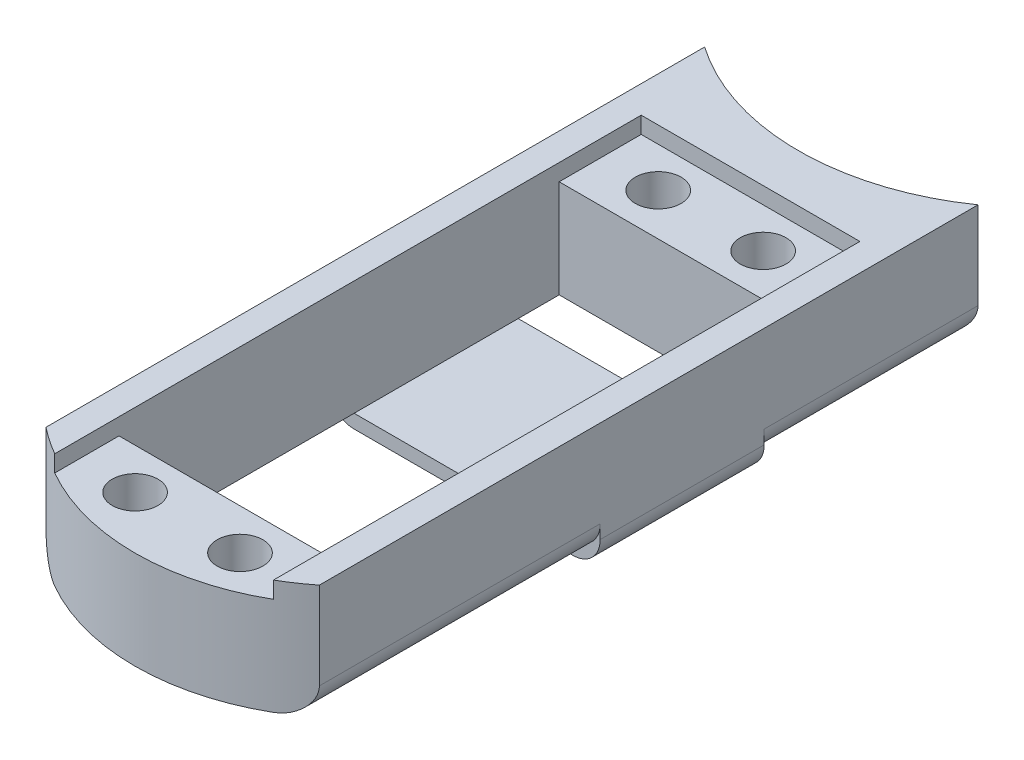
ISO-10303-21;
HEADER;
FILE_DESCRIPTION(('STEP AP214'),'2;1');
FILE_NAME('part.step','',(''),(''),'','','');
FILE_SCHEMA(('AUTOMOTIVE_DESIGN { 1 0 10303 214 1 1 1 1 }'));
ENDSEC;
DATA;
#1=APPLICATION_CONTEXT('core data for automotive mechanical design processes');
#2=APPLICATION_PROTOCOL_DEFINITION('international standard','automotive_design',2000,#1);
#3=PRODUCT_CONTEXT('',#1,'mechanical');
#4=PRODUCT('Part','Part','',(#3));
#5=PRODUCT_RELATED_PRODUCT_CATEGORY('part','',(#4));
#6=PRODUCT_DEFINITION_FORMATION('','',#4);
#7=PRODUCT_DEFINITION_CONTEXT('part definition',#1,'design');
#8=PRODUCT_DEFINITION('design','',#6,#7);
#9=PRODUCT_DEFINITION_SHAPE('','',#8);
#10=(LENGTH_UNIT() NAMED_UNIT(*) SI_UNIT(.MILLI.,.METRE.));
#11=(NAMED_UNIT(*) PLANE_ANGLE_UNIT() SI_UNIT($,.RADIAN.));
#12=(NAMED_UNIT(*) SI_UNIT($,.STERADIAN.) SOLID_ANGLE_UNIT());
#13=UNCERTAINTY_MEASURE_WITH_UNIT(LENGTH_MEASURE(1.E-05),#10,'distance_accuracy_value','');
#14=(GEOMETRIC_REPRESENTATION_CONTEXT(3) GLOBAL_UNCERTAINTY_ASSIGNED_CONTEXT((#13)) GLOBAL_UNIT_ASSIGNED_CONTEXT((#10,
#11,#12)) REPRESENTATION_CONTEXT('',''));
#15=CARTESIAN_POINT('',(0.,0.,0.));
#16=DIRECTION('',(0.,0.,1.));
#17=DIRECTION('',(1.,0.,0.));
#18=AXIS2_PLACEMENT_3D('',#15,#16,#17);
#19=CARTESIAN_POINT('',(0.,-10.65022,-63.5));
#20=DIRECTION('',(0.,1.,0.));
#21=DIRECTION('',(0.,0.,1.));
#22=AXIS2_PLACEMENT_3D('',#19,#20,#21);
#23=PLANE('',#22);
#24=CARTESIAN_POINT('',(4.87426,-10.65022,15.47622));
#25=DIRECTION('',(0.,1.,0.));
#26=DIRECTION('',(0.,0.,1.));
#27=AXIS2_PLACEMENT_3D('',#24,#25,#26);
#28=CIRCLE('',#27,2.12598);
#29=CARTESIAN_POINT('',(4.87426,-10.65022,17.6022));
#30=VERTEX_POINT('',#29);
#31=EDGE_CURVE('E869',#30,#30,#28,.F.);
#32=ORIENTED_EDGE('',*,*,#31,.F.);
#33=EDGE_LOOP('',(#32));
#34=FACE_BOUND('',#33,.T.);
#35=CARTESIAN_POINT('',(-4.87426,-10.65022,15.47622));
#36=DIRECTION('',(0.,1.,0.));
#37=DIRECTION('',(0.,0.,1.));
#38=AXIS2_PLACEMENT_3D('',#35,#36,#37);
#39=CIRCLE('',#38,2.12598);
#40=CARTESIAN_POINT('',(-4.87426,-10.65022,17.6022));
#41=VERTEX_POINT('',#40);
#42=EDGE_CURVE('E873',#41,#41,#39,.F.);
#43=ORIENTED_EDGE('',*,*,#42,.F.);
#44=EDGE_LOOP('',(#43));
#45=FACE_BOUND('',#44,.T.);
#46=DIRECTION('',(1.,0.,0.));
#47=VECTOR('',#46,1.);
#48=CARTESIAN_POINT('',(10.16,-10.65022,11.684));
#49=LINE('',#48,#47);
#50=CARTESIAN_POINT('',(-10.16,-10.65022,11.684));
#51=VERTEX_POINT('',#50);
#52=CARTESIAN_POINT('',(10.16,-10.65022,11.684));
#53=VERTEX_POINT('',#52);
#54=EDGE_CURVE('E874',#51,#53,#49,.T.);
#55=ORIENTED_EDGE('',*,*,#54,.T.);
#56=DIRECTION('',(0.,0.,-1.));
#57=VECTOR('',#56,1.);
#58=CARTESIAN_POINT('',(10.16,-10.65022,15.9273190663087));
#59=LINE('',#58,#57);
#60=CARTESIAN_POINT('',(10.16,-10.65022,17.6562706322711));
#61=VERTEX_POINT('',#60);
#62=EDGE_CURVE('E236',#53,#61,#59,.F.);
#63=ORIENTED_EDGE('',*,*,#62,.T.);
#64=CARTESIAN_POINT('',(0.,-10.65022,0.));
#65=DIRECTION('',(0.,1.,0.));
#66=DIRECTION('',(0.,0.,-1.));
#67=AXIS2_PLACEMENT_3D('',#64,#65,#66);
#68=CIRCLE('',#67,20.3708);
#69=CARTESIAN_POINT('',(-10.16,-10.65022,17.6562706322711));
#70=VERTEX_POINT('',#69);
#71=EDGE_CURVE('E413',#70,#61,#68,.T.);
#72=ORIENTED_EDGE('',*,*,#71,.F.);
#73=DIRECTION('',(0.,0.,1.));
#74=VECTOR('',#73,1.);
#75=CARTESIAN_POINT('',(-10.16,-10.65022,-10.16));
#76=LINE('',#75,#74);
#77=EDGE_CURVE('E266',#70,#51,#76,.F.);
#78=ORIENTED_EDGE('',*,*,#77,.T.);
#79=EDGE_LOOP('',(#55,#63,#72,#78));
#80=FACE_BOUND('',#79,.T.);
#81=ADVANCED_FACE('F43',(#34,#45,#80),#23,.F.);
#82=CARTESIAN_POINT('',(-10.16,-10.65022,-29.21));
#83=DIRECTION('',(0.,0.,1.));
#84=DIRECTION('',(1.,0.,0.));
#85=AXIS2_PLACEMENT_3D('',#82,#83,#84);
#86=PLANE('',#85);
#87=DIRECTION('',(0.,1.,0.));
#88=VECTOR('',#87,1.);
#89=CARTESIAN_POINT('',(10.16,-10.65022,-29.21));
#90=LINE('',#89,#88);
#91=CARTESIAN_POINT('',(10.16,-10.65022,-29.21));
#92=VERTEX_POINT('',#91);
#93=CARTESIAN_POINT('',(10.16,-1.5494,-29.21));
#94=VERTEX_POINT('',#93);
#95=EDGE_CURVE('E434',#92,#94,#90,.T.);
#96=ORIENTED_EDGE('',*,*,#95,.T.);
#97=DIRECTION('',(1.,0.,0.));
#98=VECTOR('',#97,1.);
#99=CARTESIAN_POINT('',(-10.16,-1.5494,-29.21));
#100=LINE('',#99,#98);
#101=CARTESIAN_POINT('',(-10.16,-1.5494,-29.21));
#102=VERTEX_POINT('',#101);
#103=EDGE_CURVE('E385',#102,#94,#100,.T.);
#104=ORIENTED_EDGE('',*,*,#103,.F.);
#105=DIRECTION('',(0.,1.,0.));
#106=VECTOR('',#105,1.);
#107=CARTESIAN_POINT('',(-10.16,-10.65022,-29.21));
#108=LINE('',#107,#106);
#109=CARTESIAN_POINT('',(-10.16,-10.65022,-29.21));
#110=VERTEX_POINT('',#109);
#111=EDGE_CURVE('E429',#110,#102,#108,.T.);
#112=ORIENTED_EDGE('',*,*,#111,.F.);
#113=DIRECTION('',(1.,0.,0.));
#114=VECTOR('',#113,1.);
#115=CARTESIAN_POINT('',(-10.16,-10.65022,-29.21));
#116=LINE('',#115,#114);
#117=EDGE_CURVE('E238',#110,#92,#116,.T.);
#118=ORIENTED_EDGE('',*,*,#117,.T.);
#119=EDGE_LOOP('',(#96,#104,#112,#118));
#120=FACE_BOUND('',#119,.T.);
#121=ADVANCED_FACE('F324',(#120),#86,.T.);
#122=CARTESIAN_POINT('',(0.,-10.65022,-63.5));
#123=DIRECTION('',(0.,1.,0.));
#124=DIRECTION('',(0.,0.,1.));
#125=AXIS2_PLACEMENT_3D('',#122,#123,#124);
#126=CYLINDRICAL_SURFACE('',#125,22.225);
#127=CARTESIAN_POINT('',(0.,-10.65022,-63.5));
#128=DIRECTION('',(0.,-1.,0.));
#129=DIRECTION('',(0.,0.,1.));
#130=AXIS2_PLACEMENT_3D('',#127,#128,#129);
#131=CIRCLE('',#130,22.225);
#132=CARTESIAN_POINT('',(10.16,-10.65022,-43.7332343313328));
#133=VERTEX_POINT('',#132);
#134=CARTESIAN_POINT('',(-10.16,-10.65022,-43.7332343313328));
#135=VERTEX_POINT('',#134);
#136=EDGE_CURVE('E409',#133,#135,#131,.T.);
#137=ORIENTED_EDGE('',*,*,#136,.T.);
#138=CARTESIAN_POINT('',(-10.16,-10.65022,-43.7332343313328));
#139=CARTESIAN_POINT('',(-10.2411956702707,-10.650213219014,-43.7749650155898));
#140=CARTESIAN_POINT('',(-10.3220836497185,-10.6463255690827,-43.817177586526));
#141=CARTESIAN_POINT('',(-10.4827588320444,-10.6309244694955,-43.9022797833927));
#142=CARTESIAN_POINT('',(-10.5625461683666,-10.6194119527371,-43.9451693258698));
#143=CARTESIAN_POINT('',(-10.7997970191303,-10.5735935544241,-44.0745687615082));
#144=CARTESIAN_POINT('',(-10.9549019817185,-10.5280076270302,-44.1616820960238));
#145=CARTESIAN_POINT('',(-11.25438138905,-10.4080456274678,-44.3344189820127));
#146=CARTESIAN_POINT('',(-11.3987536044259,-10.333663593684,-44.4200422211557));
#147=CARTESIAN_POINT('',(-11.6725838006467,-10.1572029252506,-44.586328174225));
#148=CARTESIAN_POINT('',(-11.8020613862865,-10.0551613051963,-44.6669973420872));
#149=CARTESIAN_POINT('',(-12.0190819062862,-9.84622195564051,-44.8049291861434));
#150=CARTESIAN_POINT('',(-12.1099415853167,-9.74378280644813,-44.8637507445398));
#151=CARTESIAN_POINT('',(-12.2757821795999,-9.52235748755073,-44.9725710674338));
#152=CARTESIAN_POINT('',(-12.3507647248859,-9.40337301855859,-45.0225707375467));
#153=CARTESIAN_POINT('',(-12.4489156896742,-9.21367993363353,-45.0886797546202));
#154=CARTESIAN_POINT('',(-12.4793654147968,-9.14821060077142,-45.1093177585253));
#155=CARTESIAN_POINT('',(-12.5348525671686,-9.01406295282559,-45.147092341245));
#156=CARTESIAN_POINT('',(-12.5598931524025,-8.94538653875295,-45.1642309627605));
#157=CARTESIAN_POINT('',(-12.6040917894358,-8.80548147194342,-45.1945850793223));
#158=CARTESIAN_POINT('',(-12.6232614871069,-8.73425818908545,-45.2078083393798));
#159=CARTESIAN_POINT('',(-12.6554056088195,-8.58982153435533,-45.2300323991752));
#160=CARTESIAN_POINT('',(-12.6683845344947,-8.51660964956995,-45.23903626697));
#161=CARTESIAN_POINT('',(-12.6853967382599,-8.38779468623727,-45.2508516687437));
#162=CARTESIAN_POINT('',(-12.6908678119887,-8.33246715196801,-45.254657191066));
#163=CARTESIAN_POINT('',(-12.6981712890002,-8.22150332769454,-45.2597402573317));
#164=CARTESIAN_POINT('',(-12.700006678167,-8.16586732871663,-45.2610198757253));
#165=CARTESIAN_POINT('',(-12.7,-8.11022,-45.2610135972418));
#166=B_SPLINE_CURVE_WITH_KNOTS('',3,(#138,#139,#140,#141,#142,#143,#144,#145,#146,#147,#148,
#149,#150,#151,#152,#153,#154,#155,#156,#157,#158,#159,#160,#161,#162,#163,#164,#165),
.UNSPECIFIED.,.F.,.F.,(4,2,2,2,2,2,2,2,2,2,2,2,2,4),(0.,0.273690290378596,0.547347101113361,
1.09548494880222,1.64373633739529,2.19125763688939,2.63661929186714,3.08193520139089,
3.30693726394514,3.53180760775837,3.75622895103776,3.98048685611531,4.14750009268392,
4.31437610907304),.UNSPECIFIED.);
#167=CARTESIAN_POINT('',(-12.7,-8.11022,-45.2610135972418));
#168=VERTEX_POINT('',#167);
#169=EDGE_CURVE('E209',#135,#168,#166,.T.);
#170=ORIENTED_EDGE('',*,*,#169,.T.);
#171=DIRECTION('',(0.,1.,0.));
#172=VECTOR('',#171,1.);
#173=CARTESIAN_POINT('',(-12.7,-10.65022,-45.2610135972418));
#174=LINE('',#173,#172);
#175=CARTESIAN_POINT('',(-12.7,0.,-45.2610135972418));
#176=VERTEX_POINT('',#175);
#177=EDGE_CURVE('E245',#168,#176,#174,.T.);
#178=ORIENTED_EDGE('',*,*,#177,.T.);
#179=CARTESIAN_POINT('',(0.,0.,-63.5));
#180=DIRECTION('',(0.,-1.,0.));
#181=DIRECTION('',(0.,0.,1.));
#182=AXIS2_PLACEMENT_3D('',#179,#180,#181);
#183=CIRCLE('',#182,22.225);
#184=CARTESIAN_POINT('',(12.7,0.,-45.2610135972418));
#185=VERTEX_POINT('',#184);
#186=EDGE_CURVE('E405',#185,#176,#183,.T.);
#187=ORIENTED_EDGE('',*,*,#186,.F.);
#188=DIRECTION('',(0.,1.,0.));
#189=VECTOR('',#188,1.);
#190=CARTESIAN_POINT('',(12.7,-10.65022,-45.2610135972418));
#191=LINE('',#190,#189);
#192=CARTESIAN_POINT('',(12.7,-8.11022,-45.2610135972418));
#193=VERTEX_POINT('',#192);
#194=EDGE_CURVE('E263',#193,#185,#191,.T.);
#195=ORIENTED_EDGE('',*,*,#194,.F.);
#196=CARTESIAN_POINT('',(12.7,-8.11022,-45.2610135972418));
#197=CARTESIAN_POINT('',(12.7000124224367,-8.17314820006339,-45.2610249850888));
#198=CARTESIAN_POINT('',(12.697661832471,-8.23606772275095,-45.2593855672142));
#199=CARTESIAN_POINT('',(12.6883304312589,-8.36136352691284,-45.252891883946));
#200=CARTESIAN_POINT('',(12.6813520374275,-8.42374007479379,-45.2480392970099));
#201=CARTESIAN_POINT('',(12.662914786554,-8.54712845561308,-45.2352434457506));
#202=CARTESIAN_POINT('',(12.6514824039029,-8.60814614091072,-45.2273184451111));
#203=CARTESIAN_POINT('',(12.6243162692221,-8.72874337089769,-45.2085392643565));
#204=CARTESIAN_POINT('',(12.6085821507773,-8.78832279260726,-45.1976848347181));
#205=CARTESIAN_POINT('',(12.5552953636709,-8.96408961751221,-45.1610509446185));
#206=CARTESIAN_POINT('',(12.511607072056,-9.07763862485482,-45.1311648891252));
#207=CARTESIAN_POINT('',(12.4098864076835,-9.29516238031463,-45.0622913627142));
#208=CARTESIAN_POINT('',(12.351834511841,-9.39912383075703,-45.0232915083138));
#209=CARTESIAN_POINT('',(12.2186176136321,-9.60342599495554,-44.9349021908279));
#210=CARTESIAN_POINT('',(12.1424869806593,-9.70289024900739,-44.8849481964341));
#211=CARTESIAN_POINT('',(11.9784857756384,-9.88786221746243,-44.7789945220317));
#212=CARTESIAN_POINT('',(11.8906115846088,-9.9733656114651,-44.7229929793912));
#213=CARTESIAN_POINT('',(11.6893301236505,-10.1431757021891,-44.5969169963657));
#214=CARTESIAN_POINT('',(11.5741251469798,-10.2247848576827,-44.5260724159635));
#215=CARTESIAN_POINT('',(11.3333267428121,-10.367324478442,-44.381262305724));
#216=CARTESIAN_POINT('',(11.2077251476008,-10.4282384898651,-44.3072943448995));
#217=CARTESIAN_POINT('',(10.9324205967515,-10.5349605578537,-44.1490061506984));
#218=CARTESIAN_POINT('',(10.781669976857,-10.5779183309013,-44.0645503917025));
#219=CARTESIAN_POINT('',(10.551183295075,-10.6211365597625,-43.9390472498577));
#220=CARTESIAN_POINT('',(10.4736148724167,-10.6320062714512,-43.8974030621034));
#221=CARTESIAN_POINT('',(10.317461436594,-10.6465447506022,-43.8147661767872));
#222=CARTESIAN_POINT('',(10.2388763963794,-10.6502133260574,-43.7737734966256));
#223=CARTESIAN_POINT('',(10.16,-10.65022,-43.7332343313328));
#224=B_SPLINE_CURVE_WITH_KNOTS('',3,(#196,#197,#198,#199,#200,#201,#202,#203,#204,#205,#206,
#207,#208,#209,#210,#211,#212,#213,#214,#215,#216,#217,#218,#219,#220,#221,#222,#223),
.UNSPECIFIED.,.F.,.F.,(4,2,2,2,2,2,2,2,2,2,2,2,2,4),(0.,0.188705087469158,0.37731167907055,
0.564813894231544,0.752332085520987,1.12636493511534,1.50090899205671,1.9039338666932,
2.30708322808382,2.77907439630294,3.25143995153968,3.78301082538282,4.04888119911061,
4.31475866176425),.UNSPECIFIED.);
#225=EDGE_CURVE('E312',#193,#133,#224,.T.);
#226=ORIENTED_EDGE('',*,*,#225,.T.);
#227=EDGE_LOOP('',(#137,#170,#178,#187,#195,#226));
#228=FACE_BOUND('',#227,.T.);
#229=ADVANCED_FACE('F319',(#228),#126,.F.);
#230=CARTESIAN_POINT('',(12.7,-10.65022,-45.2610135972418));
#231=DIRECTION('',(1.,0.,0.));
#232=DIRECTION('',(0.,0.,-1.));
#233=AXIS2_PLACEMENT_3D('',#230,#231,#232);
#234=PLANE('',#233);
#235=DIRECTION('',(0.,1.,0.));
#236=VECTOR('',#235,1.);
#237=CARTESIAN_POINT('',(12.7,-10.65022,-10.16));
#238=LINE('',#237,#236);
#239=CARTESIAN_POINT('',(12.7,-9.38022,-10.16));
#240=VERTEX_POINT('',#239);
#241=CARTESIAN_POINT('',(12.7,-8.11022,-10.16));
#242=VERTEX_POINT('',#241);
#243=EDGE_CURVE('E202',#240,#242,#238,.T.);
#244=ORIENTED_EDGE('',*,*,#243,.F.);
#245=DIRECTION('',(0.,0.,1.));
#246=VECTOR('',#245,1.);
#247=CARTESIAN_POINT('',(12.7,-9.38022,-45.2610135972418));
#248=LINE('',#247,#246);
#249=CARTESIAN_POINT('',(12.7,-9.38022,-25.4));
#250=VERTEX_POINT('',#249);
#251=EDGE_CURVE('E67',#240,#250,#248,.F.);
#252=ORIENTED_EDGE('',*,*,#251,.T.);
#253=DIRECTION('',(0.,1.,0.));
#254=VECTOR('',#253,1.);
#255=CARTESIAN_POINT('',(12.7,-10.65022,-25.4));
#256=LINE('',#255,#254);
#257=CARTESIAN_POINT('',(12.7,-8.11022,-25.4));
#258=VERTEX_POINT('',#257);
#259=EDGE_CURVE('E476',#250,#258,#256,.T.);
#260=ORIENTED_EDGE('',*,*,#259,.T.);
#261=DIRECTION('',(0.,0.,-1.));
#262=VECTOR('',#261,1.);
#263=CARTESIAN_POINT('',(12.7,-8.11022,-45.2610135972418));
#264=LINE('',#263,#262);
#265=EDGE_CURVE('E258',#258,#193,#264,.T.);
#266=ORIENTED_EDGE('',*,*,#265,.T.);
#267=ORIENTED_EDGE('',*,*,#194,.T.);
#268=DIRECTION('',(0.,0.,-1.));
#269=VECTOR('',#268,1.);
#270=CARTESIAN_POINT('',(12.7,0.,-45.2610135972418));
#271=LINE('',#270,#269);
#272=CARTESIAN_POINT('',(12.7,0.,15.9273190663087));
#273=VERTEX_POINT('',#272);
#274=EDGE_CURVE('E414',#273,#185,#271,.T.);
#275=ORIENTED_EDGE('',*,*,#274,.F.);
#276=DIRECTION('',(0.,1.,0.));
#277=VECTOR('',#276,1.);
#278=CARTESIAN_POINT('',(12.7,-10.65022,15.9273190663087));
#279=LINE('',#278,#277);
#280=CARTESIAN_POINT('',(12.7,-8.11022,15.9273190663087));
#281=VERTEX_POINT('',#280);
#282=EDGE_CURVE('E443',#281,#273,#279,.T.);
#283=ORIENTED_EDGE('',*,*,#282,.F.);
#284=DIRECTION('',(0.,0.,-1.));
#285=VECTOR('',#284,1.);
#286=CARTESIAN_POINT('',(12.7,-8.11022,-10.16));
#287=LINE('',#286,#285);
#288=EDGE_CURVE('E262',#281,#242,#287,.T.);
#289=ORIENTED_EDGE('',*,*,#288,.T.);
#290=EDGE_LOOP('',(#244,#252,#260,#266,#267,#275,#283,#289));
#291=FACE_BOUND('',#290,.T.);
#292=ADVANCED_FACE('F323',(#291),#234,.T.);
#293=CARTESIAN_POINT('',(0.,-10.65022,0.));
#294=DIRECTION('',(0.,1.,0.));
#295=DIRECTION('',(0.,0.,1.));
#296=AXIS2_PLACEMENT_3D('',#293,#294,#295);
#297=CYLINDRICAL_SURFACE('',#296,20.3708);
#298=ORIENTED_EDGE('',*,*,#71,.T.);
#299=CARTESIAN_POINT('',(10.16,-10.65022,17.6562706322711));
#300=CARTESIAN_POINT('',(10.2538148162083,-10.6502159756248,17.6022982258125));
#301=CARTESIAN_POINT('',(10.3471674475375,-10.6450228719741,17.5475734132174));
#302=CARTESIAN_POINT('',(10.5321745938138,-10.6245295733965,17.4371524894438));
#303=CARTESIAN_POINT('',(10.6238291400995,-10.6092295651864,17.3814563962275));
#304=CARTESIAN_POINT('',(10.8050212525753,-10.5687149404447,17.2694071104446));
#305=CARTESIAN_POINT('',(10.8945492085416,-10.5434620282995,17.2130522054908));
#306=CARTESIAN_POINT('',(11.0703593551201,-10.483294213634,17.1005130762806));
#307=CARTESIAN_POINT('',(11.1566418723022,-10.4483802862163,17.044328835377));
#308=CARTESIAN_POINT('',(11.3912842326355,-10.3380268220991,16.8890636509127));
#309=CARTESIAN_POINT('',(11.5354630338032,-10.2522395644561,16.7907718473207));
#310=CARTESIAN_POINT('',(11.8066915135068,-10.0514567455969,16.6011701710848));
#311=CARTESIAN_POINT('',(11.9337793307209,-9.93652792660382,16.5098449565371));
#312=CARTESIAN_POINT('',(12.1356968003703,-9.71171506887298,16.3617175092734));
#313=CARTESIAN_POINT('',(12.215546378669,-9.608192640662,16.3020903513741));
#314=CARTESIAN_POINT('',(12.3601287737346,-9.38634705413062,16.1927424902321));
#315=CARTESIAN_POINT('',(12.424878347384,-9.26804052829626,16.1430108147915));
#316=CARTESIAN_POINT('',(12.5271444792161,-9.03835898170032,16.0637375779615));
#317=CARTESIAN_POINT('',(12.5673508843979,-8.92885775815248,16.0322452095407));
#318=CARTESIAN_POINT('',(12.6326616499522,-8.70292129277281,15.9808355344892));
#319=CARTESIAN_POINT('',(12.657795459929,-8.58650006427387,15.9608956586124));
#320=CARTESIAN_POINT('',(12.6830491666576,-8.40921736244485,15.9408237434623));
#321=CARTESIAN_POINT('',(12.6893924894487,-8.34971669183741,15.9357728382344));
#322=CARTESIAN_POINT('',(12.6978706521246,-8.23022887700469,15.9290171460207));
#323=CARTESIAN_POINT('',(12.7000055143872,-8.17024173536782,15.9273123412427));
#324=CARTESIAN_POINT('',(12.7,-8.11022,15.9273190663087));
#325=B_SPLINE_CURVE_WITH_KNOTS('',3,(#299,#300,#301,#302,#303,#304,#305,#306,#307,#308,#309,
#310,#311,#312,#313,#314,#315,#316,#317,#318,#319,#320,#321,#322,#323,#324),.UNSPECIFIED.,.F.,
.F.,(4,2,2,2,2,2,2,2,2,2,2,2,4),(0.,0.324531610117718,0.649057224944756,0.974843896318075,
1.30059769747699,1.88091956121222,2.45992414684536,2.88940644684679,3.31840984636045,
3.67941179184597,4.03970607560343,4.21964404381826,4.39958105524908),.UNSPECIFIED.);
#326=EDGE_CURVE('E280',#61,#281,#325,.T.);
#327=ORIENTED_EDGE('',*,*,#326,.T.);
#328=ORIENTED_EDGE('',*,*,#282,.T.);
#329=CARTESIAN_POINT('',(0.,0.,0.));
#330=DIRECTION('',(0.,1.,0.));
#331=DIRECTION('',(0.,0.,1.));
#332=AXIS2_PLACEMENT_3D('',#329,#330,#331);
#333=CIRCLE('',#332,20.3708);
#334=CARTESIAN_POINT('',(10.16,0.,17.6562706322711));
#335=VERTEX_POINT('',#334);
#336=EDGE_CURVE('E451',#335,#273,#333,.T.);
#337=ORIENTED_EDGE('',*,*,#336,.F.);
#338=DIRECTION('',(0.,1.,0.));
#339=VECTOR('',#338,1.);
#340=CARTESIAN_POINT('',(10.16,-10.65022,17.6562706322711));
#341=LINE('',#340,#339);
#342=CARTESIAN_POINT('',(10.16,-1.5494,17.6562706322711));
#343=VERTEX_POINT('',#342);
#344=EDGE_CURVE('E438',#343,#335,#341,.T.);
#345=ORIENTED_EDGE('',*,*,#344,.F.);
#346=CARTESIAN_POINT('',(0.,-1.5494,0.));
#347=DIRECTION('',(0.,1.,0.));
#348=DIRECTION('',(0.,0.,1.));
#349=AXIS2_PLACEMENT_3D('',#346,#347,#348);
#350=CIRCLE('',#349,20.3708);
#351=CARTESIAN_POINT('',(-10.16,-1.5494,17.6562706322711));
#352=VERTEX_POINT('',#351);
#353=EDGE_CURVE('E897',#352,#343,#350,.T.);
#354=ORIENTED_EDGE('',*,*,#353,.F.);
#355=DIRECTION('',(0.,1.,0.));
#356=VECTOR('',#355,1.);
#357=CARTESIAN_POINT('',(-10.16,-10.65022,17.6562706322711));
#358=LINE('',#357,#356);
#359=CARTESIAN_POINT('',(-10.16,0.,17.6562706322711));
#360=VERTEX_POINT('',#359);
#361=EDGE_CURVE('E254',#352,#360,#358,.T.);
#362=ORIENTED_EDGE('',*,*,#361,.T.);
#363=CARTESIAN_POINT('',(0.,0.,0.));
#364=DIRECTION('',(0.,1.,0.));
#365=DIRECTION('',(0.,0.,-1.));
#366=AXIS2_PLACEMENT_3D('',#363,#364,#365);
#367=CIRCLE('',#366,20.3708);
#368=CARTESIAN_POINT('',(-12.7,0.,15.9273190663087));
#369=VERTEX_POINT('',#368);
#370=EDGE_CURVE('E462',#369,#360,#367,.T.);
#371=ORIENTED_EDGE('',*,*,#370,.F.);
#372=DIRECTION('',(0.,1.,0.));
#373=VECTOR('',#372,1.);
#374=CARTESIAN_POINT('',(-12.7,-10.65022,15.9273190663087));
#375=LINE('',#374,#373);
#376=CARTESIAN_POINT('',(-12.7,-8.11022,15.9273190663087));
#377=VERTEX_POINT('',#376);
#378=EDGE_CURVE('E247',#377,#369,#375,.T.);
#379=ORIENTED_EDGE('',*,*,#378,.F.);
#380=CARTESIAN_POINT('',(-12.7,-8.11022,15.9273190663087));
#381=CARTESIAN_POINT('',(-12.7000133519998,-8.17139406363251,15.9273053521786));
#382=CARTESIAN_POINT('',(-12.6977904530714,-8.23255801319959,15.9290808329105));
#383=CARTESIAN_POINT('',(-12.6889753096657,-8.35433079708027,15.9361054161304));
#384=CARTESIAN_POINT('',(-12.6823859033071,-8.41493996606208,15.9413522623156));
#385=CARTESIAN_POINT('',(-12.6650010104189,-8.53473315481904,15.9551670981723));
#386=CARTESIAN_POINT('',(-12.6542349422509,-8.59392413382748,15.9637118568498));
#387=CARTESIAN_POINT('',(-12.6286840271113,-8.71087526449833,15.9839324844282));
#388=CARTESIAN_POINT('',(-12.6138987276821,-8.76863525427047,15.9956087058458));
#389=CARTESIAN_POINT('',(-12.5639130336118,-8.93891743741741,16.0349426679583));
#390=CARTESIAN_POINT('',(-12.5230238589514,-9.04883498684441,16.0669532032401));
#391=CARTESIAN_POINT('',(-12.4280943392738,-9.25946142878988,16.1404942454451));
#392=CARTESIAN_POINT('',(-12.3740318469676,-9.36015441632788,16.1820407776093));
#393=CARTESIAN_POINT('',(-12.2494982461465,-9.55956842462098,16.2765448050743));
#394=CARTESIAN_POINT('',(-12.1779946484709,-9.65731532040022,16.3301889938996));
#395=CARTESIAN_POINT('',(-12.0241463237678,-9.83961388049437,16.4437998228766));
#396=CARTESIAN_POINT('',(-11.9417989117826,-9.924162265454,16.5037680281371));
#397=CARTESIAN_POINT('',(-11.7498287407028,-10.096163331412,16.641144781871));
#398=CARTESIAN_POINT('',(-11.6381150159223,-10.1804736782935,16.7195655644681));
#399=CARTESIAN_POINT('',(-11.404188424463,-10.328959676251,16.8799913184253));
#400=CARTESIAN_POINT('',(-11.2819644448351,-10.3931136732741,16.9620000373371));
#401=CARTESIAN_POINT('',(-11.077475318987,-10.4802597339169,17.0958426128462));
#402=CARTESIAN_POINT('',(-10.9976327383119,-10.5096355234822,17.1473264988212));
#403=CARTESIAN_POINT('',(-10.8353815098576,-10.5602568048425,17.2503109112827));
#404=CARTESIAN_POINT('',(-10.7529724586913,-10.5815010115034,17.3018114391132));
#405=CARTESIAN_POINT('',(-10.5862187165114,-10.6156496842739,17.4043391767418));
#406=CARTESIAN_POINT('',(-10.501875079963,-10.62855858679,17.455366624055));
#407=CARTESIAN_POINT('',(-10.331815993056,-10.6458423830279,17.5565640115108));
#408=CARTESIAN_POINT('',(-10.246100580599,-10.6502175121262,17.6067339752667));
#409=CARTESIAN_POINT('',(-10.16,-10.65022,17.6562706322711));
#410=B_SPLINE_CURVE_WITH_KNOTS('',3,(#380,#381,#382,#383,#384,#385,#386,#387,#388,#389,#390,
#391,#392,#393,#394,#395,#396,#397,#398,#399,#400,#401,#402,#403,#404,#405,#406,#407,#408,#409),
.UNSPECIFIED.,.F.,.F.,(4,2,2,2,2,2,2,2,2,2,2,2,2,2,4),(0.,0.183439532932148,0.3667599516277,
0.548811931931778,0.73088441489894,1.09384391609419,1.45741789534638,1.85336879060913,
2.24941790937985,2.7289240999277,3.20894367841838,3.50693940974972,3.80498221758558,
4.10286626320486,4.40074209253602),.UNSPECIFIED.);
#411=EDGE_CURVE('E271',#377,#70,#410,.T.);
#412=ORIENTED_EDGE('',*,*,#411,.T.);
#413=EDGE_LOOP('',(#298,#327,#328,#337,#345,#354,#362,#371,#379,#412));
#414=FACE_BOUND('',#413,.T.);
#415=ADVANCED_FACE('F287',(#414),#297,.T.);
#416=CARTESIAN_POINT('',(10.16,-10.65022,-29.21));
#417=DIRECTION('',(-1.,0.,0.));
#418=DIRECTION('',(0.,0.,1.));
#419=AXIS2_PLACEMENT_3D('',#416,#417,#418);
#420=PLANE('',#419);
#421=DIRECTION('',(0.,1.,0.));
#422=VECTOR('',#421,1.);
#423=CARTESIAN_POINT('',(10.16,-32.7491542331254,11.684));
#424=LINE('',#423,#422);
#425=CARTESIAN_POINT('',(10.16,-1.5494,11.684));
#426=VERTEX_POINT('',#425);
#427=EDGE_CURVE('E901',#53,#426,#424,.T.);
#428=ORIENTED_EDGE('',*,*,#427,.T.);
#429=DIRECTION('',(0.,0.,-1.));
#430=VECTOR('',#429,1.);
#431=CARTESIAN_POINT('',(10.16,-1.5494,17.6562706322712));
#432=LINE('',#431,#430);
#433=EDGE_CURVE('E885',#343,#426,#432,.T.);
#434=ORIENTED_EDGE('',*,*,#433,.F.);
#435=ORIENTED_EDGE('',*,*,#344,.T.);
#436=DIRECTION('',(0.,0.,1.));
#437=VECTOR('',#436,1.);
#438=CARTESIAN_POINT('',(10.16,0.,-29.21));
#439=LINE('',#438,#437);
#440=CARTESIAN_POINT('',(10.16,0.,-36.83));
#441=VERTEX_POINT('',#440);
#442=EDGE_CURVE('E455',#441,#335,#439,.T.);
#443=ORIENTED_EDGE('',*,*,#442,.F.);
#444=DIRECTION('',(0.,1.,0.));
#445=VECTOR('',#444,1.);
#446=CARTESIAN_POINT('',(10.16,-1.5494,-36.83));
#447=LINE('',#446,#445);
#448=CARTESIAN_POINT('',(10.16,-1.5494,-36.83));
#449=VERTEX_POINT('',#448);
#450=EDGE_CURVE('E397',#449,#441,#447,.T.);
#451=ORIENTED_EDGE('',*,*,#450,.F.);
#452=DIRECTION('',(0.,0.,-1.));
#453=VECTOR('',#452,1.);
#454=CARTESIAN_POINT('',(10.16,-1.5494,-36.83));
#455=LINE('',#454,#453);
#456=EDGE_CURVE('E389',#94,#449,#455,.T.);
#457=ORIENTED_EDGE('',*,*,#456,.F.);
#458=ORIENTED_EDGE('',*,*,#95,.F.);
#459=DIRECTION('',(0.,0.,1.));
#460=VECTOR('',#459,1.);
#461=CARTESIAN_POINT('',(10.16,-10.65022,-29.21));
#462=LINE('',#461,#460);
#463=CARTESIAN_POINT('',(10.16,-10.65022,-25.4));
#464=VERTEX_POINT('',#463);
#465=EDGE_CURVE('E229',#92,#464,#462,.T.);
#466=ORIENTED_EDGE('',*,*,#465,.T.);
#467=CARTESIAN_POINT('',(10.16,-10.65022,-10.16));
#468=VERTEX_POINT('',#467);
#469=EDGE_CURVE('E216',#464,#468,#462,.T.);
#470=ORIENTED_EDGE('',*,*,#469,.T.);
#471=EDGE_CURVE('E225',#468,#53,#462,.T.);
#472=ORIENTED_EDGE('',*,*,#471,.T.);
#473=EDGE_LOOP('',(#428,#434,#435,#443,#451,#457,#458,#466,#470,#472));
#474=FACE_BOUND('',#473,.T.);
#475=ADVANCED_FACE('F224',(#474),#420,.T.);
#476=CARTESIAN_POINT('',(-10.16,-10.65022,-29.21));
#477=DIRECTION('',(1.,0.,0.));
#478=DIRECTION('',(0.,0.,-1.));
#479=AXIS2_PLACEMENT_3D('',#476,#477,#478);
#480=PLANE('',#479);
#481=DIRECTION('',(0.,1.,0.));
#482=VECTOR('',#481,1.);
#483=CARTESIAN_POINT('',(-10.16,-32.7491542331254,11.684));
#484=LINE('',#483,#482);
#485=CARTESIAN_POINT('',(-10.16,-1.5494,11.684));
#486=VERTEX_POINT('',#485);
#487=EDGE_CURVE('E877',#51,#486,#484,.T.);
#488=ORIENTED_EDGE('',*,*,#487,.F.);
#489=DIRECTION('',(0.,0.,-1.));
#490=VECTOR('',#489,1.);
#491=CARTESIAN_POINT('',(-10.16,-10.65022,-29.21));
#492=LINE('',#491,#490);
#493=CARTESIAN_POINT('',(-10.16,-10.65022,-10.16));
#494=VERTEX_POINT('',#493);
#495=EDGE_CURVE('E241',#51,#494,#492,.T.);
#496=ORIENTED_EDGE('',*,*,#495,.T.);
#497=CARTESIAN_POINT('',(-10.16,-10.65022,-25.4));
#498=VERTEX_POINT('',#497);
#499=EDGE_CURVE('E219',#494,#498,#492,.T.);
#500=ORIENTED_EDGE('',*,*,#499,.T.);
#501=EDGE_CURVE('E418',#498,#110,#492,.T.);
#502=ORIENTED_EDGE('',*,*,#501,.T.);
#503=ORIENTED_EDGE('',*,*,#111,.T.);
#504=DIRECTION('',(0.,0.,1.));
#505=VECTOR('',#504,1.);
#506=CARTESIAN_POINT('',(-10.16,-1.5494,-36.83));
#507=LINE('',#506,#505);
#508=CARTESIAN_POINT('',(-10.16,-1.5494,-36.83));
#509=VERTEX_POINT('',#508);
#510=EDGE_CURVE('E382',#509,#102,#507,.T.);
#511=ORIENTED_EDGE('',*,*,#510,.F.);
#512=DIRECTION('',(0.,1.,0.));
#513=VECTOR('',#512,1.);
#514=CARTESIAN_POINT('',(-10.16,-1.5494,-36.83));
#515=LINE('',#514,#513);
#516=CARTESIAN_POINT('',(-10.16,0.,-36.83));
#517=VERTEX_POINT('',#516);
#518=EDGE_CURVE('E401',#509,#517,#515,.T.);
#519=ORIENTED_EDGE('',*,*,#518,.T.);
#520=DIRECTION('',(0.,0.,-1.));
#521=VECTOR('',#520,1.);
#522=CARTESIAN_POINT('',(-10.16,0.,-29.21));
#523=LINE('',#522,#521);
#524=EDGE_CURVE('E459',#360,#517,#523,.T.);
#525=ORIENTED_EDGE('',*,*,#524,.F.);
#526=ORIENTED_EDGE('',*,*,#361,.F.);
#527=DIRECTION('',(0.,0.,1.));
#528=VECTOR('',#527,1.);
#529=CARTESIAN_POINT('',(-10.16,-1.5494,11.684));
#530=LINE('',#529,#528);
#531=EDGE_CURVE('E893',#486,#352,#530,.T.);
#532=ORIENTED_EDGE('',*,*,#531,.F.);
#533=EDGE_LOOP('',(#488,#496,#500,#502,#503,#511,#519,#525,#526,#532));
#534=FACE_BOUND('',#533,.T.);
#535=ADVANCED_FACE('F330',(#534),#480,.T.);
#536=CARTESIAN_POINT('',(-12.7,-10.65022,-45.2610135972418));
#537=DIRECTION('',(-1.,0.,0.));
#538=DIRECTION('',(0.,0.,1.));
#539=AXIS2_PLACEMENT_3D('',#536,#537,#538);
#540=PLANE('',#539);
#541=DIRECTION('',(0.,-1.,0.));
#542=VECTOR('',#541,1.);
#543=CARTESIAN_POINT('',(-12.7,-10.65022,-25.4));
#544=LINE('',#543,#542);
#545=CARTESIAN_POINT('',(-12.7,-8.11022,-25.4));
#546=VERTEX_POINT('',#545);
#547=CARTESIAN_POINT('',(-12.7,-9.38022,-25.4));
#548=VERTEX_POINT('',#547);
#549=EDGE_CURVE('E221',#546,#548,#544,.T.);
#550=ORIENTED_EDGE('',*,*,#549,.T.);
#551=DIRECTION('',(0.,0.,1.));
#552=VECTOR('',#551,1.);
#553=CARTESIAN_POINT('',(-12.7,-9.38022,-45.2610135972418));
#554=LINE('',#553,#552);
#555=CARTESIAN_POINT('',(-12.7,-9.38022,-10.16));
#556=VERTEX_POINT('',#555);
#557=EDGE_CURVE('E11',#548,#556,#554,.T.);
#558=ORIENTED_EDGE('',*,*,#557,.T.);
#559=DIRECTION('',(0.,-1.,0.));
#560=VECTOR('',#559,1.);
#561=CARTESIAN_POINT('',(-12.7,-10.65022,-10.16));
#562=LINE('',#561,#560);
#563=CARTESIAN_POINT('',(-12.7,-8.11022,-10.16));
#564=VERTEX_POINT('',#563);
#565=EDGE_CURVE('E540',#564,#556,#562,.T.);
#566=ORIENTED_EDGE('',*,*,#565,.F.);
#567=DIRECTION('',(0.,0.,1.));
#568=VECTOR('',#567,1.);
#569=CARTESIAN_POINT('',(-12.7,-8.11022,15.9273190663087));
#570=LINE('',#569,#568);
#571=EDGE_CURVE('E486',#564,#377,#570,.T.);
#572=ORIENTED_EDGE('',*,*,#571,.T.);
#573=ORIENTED_EDGE('',*,*,#378,.T.);
#574=DIRECTION('',(0.,0.,1.));
#575=VECTOR('',#574,1.);
#576=CARTESIAN_POINT('',(-12.7,0.,-45.2610135972418));
#577=LINE('',#576,#575);
#578=EDGE_CURVE('E466',#176,#369,#577,.T.);
#579=ORIENTED_EDGE('',*,*,#578,.F.);
#580=ORIENTED_EDGE('',*,*,#177,.F.);
#581=DIRECTION('',(0.,0.,1.));
#582=VECTOR('',#581,1.);
#583=CARTESIAN_POINT('',(-12.7,-8.11022,-25.4));
#584=LINE('',#583,#582);
#585=EDGE_CURVE('E491',#168,#546,#584,.T.);
#586=ORIENTED_EDGE('',*,*,#585,.T.);
#587=EDGE_LOOP('',(#550,#558,#566,#572,#573,#579,#580,#586));
#588=FACE_BOUND('',#587,.T.);
#589=ADVANCED_FACE('F325',(#588),#540,.T.);
#590=ORIENTED_EDGE('',*,*,#117,.F.);
#591=DIRECTION('',(0.,0.,1.));
#592=VECTOR('',#591,1.);
#593=CARTESIAN_POINT('',(-10.16,-10.65022,-45.2610135972418));
#594=LINE('',#593,#592);
#595=EDGE_CURVE('E483',#110,#135,#594,.F.);
#596=ORIENTED_EDGE('',*,*,#595,.T.);
#597=ORIENTED_EDGE('',*,*,#136,.F.);
#598=DIRECTION('',(0.,0.,-1.));
#599=VECTOR('',#598,1.);
#600=CARTESIAN_POINT('',(10.16,-10.65022,-25.4));
#601=LINE('',#600,#599);
#602=EDGE_CURVE('E481',#133,#92,#601,.F.);
#603=ORIENTED_EDGE('',*,*,#602,.T.);
#604=EDGE_LOOP('',(#590,#596,#597,#603));
#605=FACE_BOUND('',#604,.T.);
#606=CARTESIAN_POINT('',(-4.87426,-10.65022,-33.12414));
#607=DIRECTION('',(0.,1.,0.));
#608=DIRECTION('',(0.,0.,1.));
#609=AXIS2_PLACEMENT_3D('',#606,#607,#608);
#610=CIRCLE('',#609,2.12598);
#611=CARTESIAN_POINT('',(-4.87426,-10.65022,-30.99816));
#612=VERTEX_POINT('',#611);
#613=EDGE_CURVE('E365',#612,#612,#610,.T.);
#614=ORIENTED_EDGE('',*,*,#613,.T.);
#615=EDGE_LOOP('',(#614));
#616=FACE_BOUND('',#615,.T.);
#617=CARTESIAN_POINT('',(4.87426,-10.65022,-33.12414));
#618=DIRECTION('',(0.,1.,0.));
#619=DIRECTION('',(0.,0.,1.));
#620=AXIS2_PLACEMENT_3D('',#617,#618,#619);
#621=CIRCLE('',#620,2.12598);
#622=CARTESIAN_POINT('',(4.87426,-10.65022,-30.99816));
#623=VERTEX_POINT('',#622);
#624=EDGE_CURVE('E368',#623,#623,#621,.T.);
#625=ORIENTED_EDGE('',*,*,#624,.T.);
#626=EDGE_LOOP('',(#625));
#627=FACE_BOUND('',#626,.T.);
#628=ADVANCED_FACE('F329',(#605,#616,#627),#23,.F.);
#629=CARTESIAN_POINT('',(0.,0.,-63.5));
#630=DIRECTION('',(0.,1.,0.));
#631=DIRECTION('',(0.,0.,1.));
#632=AXIS2_PLACEMENT_3D('',#629,#630,#631);
#633=PLANE('',#632);
#634=ORIENTED_EDGE('',*,*,#524,.T.);
#635=DIRECTION('',(-1.,0.,0.));
#636=VECTOR('',#635,1.);
#637=CARTESIAN_POINT('',(-10.16,0.,-36.83));
#638=LINE('',#637,#636);
#639=EDGE_CURVE('E375',#441,#517,#638,.T.);
#640=ORIENTED_EDGE('',*,*,#639,.F.);
#641=ORIENTED_EDGE('',*,*,#442,.T.);
#642=ORIENTED_EDGE('',*,*,#336,.T.);
#643=ORIENTED_EDGE('',*,*,#274,.T.);
#644=ORIENTED_EDGE('',*,*,#186,.T.);
#645=ORIENTED_EDGE('',*,*,#578,.T.);
#646=ORIENTED_EDGE('',*,*,#370,.T.);
#647=EDGE_LOOP('',(#634,#640,#641,#642,#643,#644,#645,#646));
#648=FACE_BOUND('',#647,.T.);
#649=ADVANCED_FACE('F352',(#648),#633,.T.);
#650=CARTESIAN_POINT('',(-10.16,-1.5494,-36.83));
#651=DIRECTION('',(0.,0.,-1.));
#652=DIRECTION('',(-1.,0.,0.));
#653=AXIS2_PLACEMENT_3D('',#650,#651,#652);
#654=PLANE('',#653);
#655=ORIENTED_EDGE('',*,*,#639,.T.);
#656=ORIENTED_EDGE('',*,*,#518,.F.);
#657=DIRECTION('',(-1.,0.,0.));
#658=VECTOR('',#657,1.);
#659=CARTESIAN_POINT('',(-10.16,-1.5494,-36.83));
#660=LINE('',#659,#658);
#661=EDGE_CURVE('E393',#449,#509,#660,.T.);
#662=ORIENTED_EDGE('',*,*,#661,.F.);
#663=ORIENTED_EDGE('',*,*,#450,.T.);
#664=EDGE_LOOP('',(#655,#656,#662,#663));
#665=FACE_BOUND('',#664,.T.);
#666=ADVANCED_FACE('F357',(#665),#654,.F.);
#667=CARTESIAN_POINT('',(0.,-1.5494,0.));
#668=DIRECTION('',(0.,1.,0.));
#669=DIRECTION('',(0.,0.,1.));
#670=AXIS2_PLACEMENT_3D('',#667,#668,#669);
#671=PLANE('',#670);
#672=CARTESIAN_POINT('',(-4.87426,-1.5494,-33.12414));
#673=DIRECTION('',(0.,1.,0.));
#674=DIRECTION('',(0.,0.,1.));
#675=AXIS2_PLACEMENT_3D('',#672,#673,#674);
#676=CIRCLE('',#675,2.12598);
#677=CARTESIAN_POINT('',(-4.87426,-1.5494,-30.99816));
#678=VERTEX_POINT('',#677);
#679=EDGE_CURVE('E371',#678,#678,#676,.T.);
#680=ORIENTED_EDGE('',*,*,#679,.F.);
#681=EDGE_LOOP('',(#680));
#682=FACE_BOUND('',#681,.T.);
#683=CARTESIAN_POINT('',(4.87426,-1.5494,-33.12414));
#684=DIRECTION('',(0.,1.,0.));
#685=DIRECTION('',(0.,0.,1.));
#686=AXIS2_PLACEMENT_3D('',#683,#684,#685);
#687=CIRCLE('',#686,2.12598);
#688=CARTESIAN_POINT('',(4.87426,-1.5494,-30.99816));
#689=VERTEX_POINT('',#688);
#690=EDGE_CURVE('E378',#689,#689,#687,.T.);
#691=ORIENTED_EDGE('',*,*,#690,.F.);
#692=EDGE_LOOP('',(#691));
#693=FACE_BOUND('',#692,.T.);
#694=ORIENTED_EDGE('',*,*,#510,.T.);
#695=ORIENTED_EDGE('',*,*,#103,.T.);
#696=ORIENTED_EDGE('',*,*,#456,.T.);
#697=ORIENTED_EDGE('',*,*,#661,.T.);
#698=EDGE_LOOP('',(#694,#695,#696,#697));
#699=FACE_BOUND('',#698,.T.);
#700=ADVANCED_FACE('F550',(#682,#693,#699),#671,.T.);
#701=CARTESIAN_POINT('',(4.87426,-20.8788,-33.12414));
#702=DIRECTION('',(0.,1.,0.));
#703=DIRECTION('',(0.,0.,1.));
#704=AXIS2_PLACEMENT_3D('',#701,#702,#703);
#705=CYLINDRICAL_SURFACE('',#704,2.12598);
#706=ORIENTED_EDGE('',*,*,#690,.T.);
#707=EDGE_LOOP('',(#706));
#708=FACE_BOUND('',#707,.T.);
#709=ORIENTED_EDGE('',*,*,#624,.F.);
#710=EDGE_LOOP('',(#709));
#711=FACE_BOUND('',#710,.T.);
#712=ADVANCED_FACE('F552',(#708,#711),#705,.F.);
#713=CARTESIAN_POINT('',(-4.87426,-20.8788,-33.12414));
#714=DIRECTION('',(0.,1.,0.));
#715=DIRECTION('',(0.,0.,1.));
#716=AXIS2_PLACEMENT_3D('',#713,#714,#715);
#717=CYLINDRICAL_SURFACE('',#716,2.12598);
#718=ORIENTED_EDGE('',*,*,#679,.T.);
#719=EDGE_LOOP('',(#718));
#720=FACE_BOUND('',#719,.T.);
#721=ORIENTED_EDGE('',*,*,#613,.F.);
#722=EDGE_LOOP('',(#721));
#723=FACE_BOUND('',#722,.T.);
#724=ADVANCED_FACE('F559',(#720,#723),#717,.F.);
#725=CARTESIAN_POINT('',(10.16,-32.7491542331254,11.684));
#726=DIRECTION('',(0.,0.,-1.));
#727=DIRECTION('',(-1.,0.,0.));
#728=AXIS2_PLACEMENT_3D('',#725,#726,#727);
#729=PLANE('',#728);
#730=ORIENTED_EDGE('',*,*,#54,.F.);
#731=ORIENTED_EDGE('',*,*,#487,.T.);
#732=DIRECTION('',(-1.,0.,0.));
#733=VECTOR('',#732,1.);
#734=CARTESIAN_POINT('',(10.16,-1.5494,11.684));
#735=LINE('',#734,#733);
#736=EDGE_CURVE('E889',#426,#486,#735,.T.);
#737=ORIENTED_EDGE('',*,*,#736,.F.);
#738=ORIENTED_EDGE('',*,*,#427,.F.);
#739=EDGE_LOOP('',(#730,#731,#737,#738));
#740=FACE_BOUND('',#739,.T.);
#741=ADVANCED_FACE('F567',(#740),#729,.T.);
#742=CARTESIAN_POINT('',(4.87426,-32.7491542331254,15.47622));
#743=DIRECTION('',(0.,1.,0.));
#744=DIRECTION('',(0.,0.,1.));
#745=AXIS2_PLACEMENT_3D('',#742,#743,#744);
#746=CYLINDRICAL_SURFACE('',#745,2.12598);
#747=ORIENTED_EDGE('',*,*,#31,.T.);
#748=EDGE_LOOP('',(#747));
#749=FACE_BOUND('',#748,.T.);
#750=CARTESIAN_POINT('',(4.87426,-1.5494,15.47622));
#751=DIRECTION('',(0.,1.,0.));
#752=DIRECTION('',(0.,0.,1.));
#753=AXIS2_PLACEMENT_3D('',#750,#751,#752);
#754=CIRCLE('',#753,2.12598);
#755=CARTESIAN_POINT('',(4.87426,-1.5494,17.6022));
#756=VERTEX_POINT('',#755);
#757=EDGE_CURVE('E881',#756,#756,#754,.T.);
#758=ORIENTED_EDGE('',*,*,#757,.T.);
#759=EDGE_LOOP('',(#758));
#760=FACE_BOUND('',#759,.T.);
#761=ADVANCED_FACE('F571',(#749,#760),#746,.F.);
#762=CARTESIAN_POINT('',(0.,-1.5494,0.));
#763=DIRECTION('',(0.,1.,0.));
#764=DIRECTION('',(0.,0.,1.));
#765=AXIS2_PLACEMENT_3D('',#762,#763,#764);
#766=PLANE('',#765);
#767=CARTESIAN_POINT('',(-4.87426,-1.5494,15.47622));
#768=DIRECTION('',(0.,1.,0.));
#769=DIRECTION('',(0.,0.,1.));
#770=AXIS2_PLACEMENT_3D('',#767,#768,#769);
#771=CIRCLE('',#770,2.12598);
#772=CARTESIAN_POINT('',(-4.87426,-1.5494,17.6022));
#773=VERTEX_POINT('',#772);
#774=EDGE_CURVE('E864',#773,#773,#771,.T.);
#775=ORIENTED_EDGE('',*,*,#774,.F.);
#776=EDGE_LOOP('',(#775));
#777=FACE_BOUND('',#776,.T.);
#778=ORIENTED_EDGE('',*,*,#757,.F.);
#779=EDGE_LOOP('',(#778));
#780=FACE_BOUND('',#779,.T.);
#781=ORIENTED_EDGE('',*,*,#433,.T.);
#782=ORIENTED_EDGE('',*,*,#736,.T.);
#783=ORIENTED_EDGE('',*,*,#531,.T.);
#784=ORIENTED_EDGE('',*,*,#353,.T.);
#785=EDGE_LOOP('',(#781,#782,#783,#784));
#786=FACE_BOUND('',#785,.T.);
#787=ADVANCED_FACE('F573',(#777,#780,#786),#766,.T.);
#788=CARTESIAN_POINT('',(-4.87426,-32.7491542331254,15.47622));
#789=DIRECTION('',(0.,1.,0.));
#790=DIRECTION('',(0.,0.,1.));
#791=AXIS2_PLACEMENT_3D('',#788,#789,#790);
#792=CYLINDRICAL_SURFACE('',#791,2.12598);
#793=ORIENTED_EDGE('',*,*,#42,.T.);
#794=EDGE_LOOP('',(#793));
#795=FACE_BOUND('',#794,.T.);
#796=ORIENTED_EDGE('',*,*,#774,.T.);
#797=EDGE_LOOP('',(#796));
#798=FACE_BOUND('',#797,.T.);
#799=ADVANCED_FACE('F576',(#795,#798),#792,.F.);
#800=CARTESIAN_POINT('',(-12.7,-10.65022,-25.4));
#801=DIRECTION('',(0.,1.,0.));
#802=DIRECTION('',(0.,0.,1.));
#803=AXIS2_PLACEMENT_3D('',#800,#801,#802);
#804=PLANE('',#803);
#805=ORIENTED_EDGE('',*,*,#499,.F.);
#806=DIRECTION('',(-1.,0.,0.));
#807=VECTOR('',#806,1.);
#808=CARTESIAN_POINT('',(-12.7,-10.65022,-10.16));
#809=LINE('',#808,#807);
#810=EDGE_CURVE('E200',#468,#494,#809,.T.);
#811=ORIENTED_EDGE('',*,*,#810,.F.);
#812=ORIENTED_EDGE('',*,*,#469,.F.);
#813=DIRECTION('',(-1.,0.,0.));
#814=VECTOR('',#813,1.);
#815=CARTESIAN_POINT('',(-12.7,-10.65022,-25.4));
#816=LINE('',#815,#814);
#817=EDGE_CURVE('E861',#464,#498,#816,.T.);
#818=ORIENTED_EDGE('',*,*,#817,.T.);
#819=EDGE_LOOP('',(#805,#811,#812,#818));
#820=FACE_BOUND('',#819,.T.);
#821=ADVANCED_FACE('F214',(#820),#804,.T.);
#822=CARTESIAN_POINT('',(-12.7,-11.92022,-25.4));
#823=DIRECTION('',(0.,-1.,0.));
#824=DIRECTION('',(0.,0.,-1.));
#825=AXIS2_PLACEMENT_3D('',#822,#823,#824);
#826=PLANE('',#825);
#827=DIRECTION('',(1.,0.,0.));
#828=VECTOR('',#827,1.);
#829=CARTESIAN_POINT('',(-12.7,-11.92022,-25.4));
#830=LINE('',#829,#828);
#831=CARTESIAN_POINT('',(-10.16,-11.92022,-25.4));
#832=VERTEX_POINT('',#831);
#833=CARTESIAN_POINT('',(10.16,-11.92022,-25.4));
#834=VERTEX_POINT('',#833);
#835=EDGE_CURVE('E518',#832,#834,#830,.T.);
#836=ORIENTED_EDGE('',*,*,#835,.T.);
#837=DIRECTION('',(0.,0.,1.));
#838=VECTOR('',#837,1.);
#839=CARTESIAN_POINT('',(10.16,-11.92022,-25.4));
#840=LINE('',#839,#838);
#841=CARTESIAN_POINT('',(10.16,-11.92022,-10.16));
#842=VERTEX_POINT('',#841);
#843=EDGE_CURVE('E522',#834,#842,#840,.T.);
#844=ORIENTED_EDGE('',*,*,#843,.T.);
#845=DIRECTION('',(1.,0.,0.));
#846=VECTOR('',#845,1.);
#847=CARTESIAN_POINT('',(-12.7,-11.92022,-10.16));
#848=LINE('',#847,#846);
#849=CARTESIAN_POINT('',(-10.16,-11.92022,-10.16));
#850=VERTEX_POINT('',#849);
#851=EDGE_CURVE('E499',#850,#842,#848,.T.);
#852=ORIENTED_EDGE('',*,*,#851,.F.);
#853=DIRECTION('',(0.,0.,1.));
#854=VECTOR('',#853,1.);
#855=CARTESIAN_POINT('',(-10.16,-11.92022,-25.4));
#856=LINE('',#855,#854);
#857=EDGE_CURVE('E524',#850,#832,#856,.F.);
#858=ORIENTED_EDGE('',*,*,#857,.T.);
#859=EDGE_LOOP('',(#836,#844,#852,#858));
#860=FACE_BOUND('',#859,.T.);
#861=ADVANCED_FACE('F520',(#860),#826,.T.);
#862=CARTESIAN_POINT('',(0.,0.,-25.4));
#863=DIRECTION('',(0.,0.,1.));
#864=DIRECTION('',(1.,0.,0.));
#865=AXIS2_PLACEMENT_3D('',#862,#863,#864);
#866=PLANE('',#865);
#867=ORIENTED_EDGE('',*,*,#259,.F.);
#868=CARTESIAN_POINT('',(10.16,-9.38022,-25.4));
#869=DIRECTION('',(0.,0.,1.));
#870=DIRECTION('',(1.,0.,0.));
#871=AXIS2_PLACEMENT_3D('',#868,#869,#870);
#872=CIRCLE('',#871,2.54);
#873=EDGE_CURVE('E52',#250,#834,#872,.F.);
#874=ORIENTED_EDGE('',*,*,#873,.T.);
#875=ORIENTED_EDGE('',*,*,#835,.F.);
#876=CARTESIAN_POINT('',(-10.16,-9.38022,-25.4));
#877=DIRECTION('',(0.,0.,1.));
#878=DIRECTION('',(1.,0.,0.));
#879=AXIS2_PLACEMENT_3D('',#876,#877,#878);
#880=CIRCLE('',#879,2.54);
#881=EDGE_CURVE('E59',#832,#548,#880,.F.);
#882=ORIENTED_EDGE('',*,*,#881,.T.);
#883=ORIENTED_EDGE('',*,*,#549,.F.);
#884=CARTESIAN_POINT('',(-10.16,-8.11022,-25.4));
#885=DIRECTION('',(0.,0.,1.));
#886=DIRECTION('',(1.,0.,0.));
#887=AXIS2_PLACEMENT_3D('',#884,#885,#886);
#888=CIRCLE('',#887,2.54);
#889=EDGE_CURVE('E535',#546,#498,#888,.T.);
#890=ORIENTED_EDGE('',*,*,#889,.T.);
#891=ORIENTED_EDGE('',*,*,#817,.F.);
#892=CARTESIAN_POINT('',(10.16,-8.11022,-25.4));
#893=DIRECTION('',(0.,0.,1.));
#894=DIRECTION('',(1.,0.,0.));
#895=AXIS2_PLACEMENT_3D('',#892,#893,#894);
#896=CIRCLE('',#895,2.54);
#897=EDGE_CURVE('E479',#464,#258,#896,.T.);
#898=ORIENTED_EDGE('',*,*,#897,.T.);
#899=EDGE_LOOP('',(#867,#874,#875,#882,#883,#890,#891,#898));
#900=FACE_BOUND('',#899,.T.);
#901=ADVANCED_FACE('F517',(#900),#866,.F.);
#902=CARTESIAN_POINT('',(0.,0.,-10.16));
#903=DIRECTION('',(0.,0.,1.));
#904=DIRECTION('',(1.,0.,0.));
#905=AXIS2_PLACEMENT_3D('',#902,#903,#904);
#906=PLANE('',#905);
#907=ORIENTED_EDGE('',*,*,#851,.T.);
#908=CARTESIAN_POINT('',(10.16,-9.38022,-10.16));
#909=DIRECTION('',(0.,0.,1.));
#910=DIRECTION('',(1.,0.,0.));
#911=AXIS2_PLACEMENT_3D('',#908,#909,#910);
#912=CIRCLE('',#911,2.54);
#913=EDGE_CURVE('E505',#842,#240,#912,.T.);
#914=ORIENTED_EDGE('',*,*,#913,.T.);
#915=ORIENTED_EDGE('',*,*,#243,.T.);
#916=CARTESIAN_POINT('',(10.16,-8.11022,-10.16));
#917=DIRECTION('',(0.,0.,1.));
#918=DIRECTION('',(1.,0.,0.));
#919=AXIS2_PLACEMENT_3D('',#916,#917,#918);
#920=CIRCLE('',#919,2.54);
#921=EDGE_CURVE('E195',#242,#468,#920,.F.);
#922=ORIENTED_EDGE('',*,*,#921,.T.);
#923=ORIENTED_EDGE('',*,*,#810,.T.);
#924=CARTESIAN_POINT('',(-10.16,-8.11022,-10.16));
#925=DIRECTION('',(0.,0.,1.));
#926=DIRECTION('',(1.,0.,0.));
#927=AXIS2_PLACEMENT_3D('',#924,#925,#926);
#928=CIRCLE('',#927,2.54);
#929=EDGE_CURVE('E208',#494,#564,#928,.F.);
#930=ORIENTED_EDGE('',*,*,#929,.T.);
#931=ORIENTED_EDGE('',*,*,#565,.T.);
#932=CARTESIAN_POINT('',(-10.16,-9.38022,-10.16));
#933=DIRECTION('',(0.,0.,1.));
#934=DIRECTION('',(1.,0.,0.));
#935=AXIS2_PLACEMENT_3D('',#932,#933,#934);
#936=CIRCLE('',#935,2.54);
#937=EDGE_CURVE('E512',#556,#850,#936,.T.);
#938=ORIENTED_EDGE('',*,*,#937,.T.);
#939=EDGE_LOOP('',(#907,#914,#915,#922,#923,#930,#931,#938));
#940=FACE_BOUND('',#939,.T.);
#941=ADVANCED_FACE('F198',(#940),#906,.T.);
#942=CARTESIAN_POINT('',(10.16,-8.11022,-45.2610135972418));
#943=DIRECTION('',(0.,0.,1.));
#944=DIRECTION('',(1.,0.,0.));
#945=AXIS2_PLACEMENT_3D('',#942,#943,#944);
#946=CYLINDRICAL_SURFACE('',#945,2.54);
#947=ORIENTED_EDGE('',*,*,#62,.F.);
#948=ORIENTED_EDGE('',*,*,#471,.F.);
#949=ORIENTED_EDGE('',*,*,#921,.F.);
#950=ORIENTED_EDGE('',*,*,#288,.F.);
#951=ORIENTED_EDGE('',*,*,#326,.F.);
#952=EDGE_LOOP('',(#947,#948,#949,#950,#951));
#953=FACE_BOUND('',#952,.T.);
#954=ADVANCED_FACE('F234',(#953),#946,.T.);
#955=CARTESIAN_POINT('',(-10.16,-8.11022,-45.2610135972418));
#956=DIRECTION('',(0.,0.,-1.));
#957=DIRECTION('',(-1.,0.,0.));
#958=AXIS2_PLACEMENT_3D('',#955,#956,#957);
#959=CYLINDRICAL_SURFACE('',#958,2.54);
#960=ORIENTED_EDGE('',*,*,#495,.F.);
#961=ORIENTED_EDGE('',*,*,#77,.F.);
#962=ORIENTED_EDGE('',*,*,#411,.F.);
#963=ORIENTED_EDGE('',*,*,#571,.F.);
#964=ORIENTED_EDGE('',*,*,#929,.F.);
#965=EDGE_LOOP('',(#960,#961,#962,#963,#964));
#966=FACE_BOUND('',#965,.T.);
#967=ADVANCED_FACE('F291',(#966),#959,.T.);
#968=CARTESIAN_POINT('',(-10.16,-8.11022,-45.2610135972418));
#969=DIRECTION('',(0.,0.,-1.));
#970=DIRECTION('',(-1.,0.,0.));
#971=AXIS2_PLACEMENT_3D('',#968,#969,#970);
#972=CYLINDRICAL_SURFACE('',#971,2.54);
#973=ORIENTED_EDGE('',*,*,#595,.F.);
#974=ORIENTED_EDGE('',*,*,#501,.F.);
#975=ORIENTED_EDGE('',*,*,#889,.F.);
#976=ORIENTED_EDGE('',*,*,#585,.F.);
#977=ORIENTED_EDGE('',*,*,#169,.F.);
#978=EDGE_LOOP('',(#973,#974,#975,#976,#977));
#979=FACE_BOUND('',#978,.T.);
#980=ADVANCED_FACE('F295',(#979),#972,.T.);
#981=CARTESIAN_POINT('',(10.16,-8.11022,-45.2610135972418));
#982=DIRECTION('',(0.,0.,1.));
#983=DIRECTION('',(1.,0.,0.));
#984=AXIS2_PLACEMENT_3D('',#981,#982,#983);
#985=CYLINDRICAL_SURFACE('',#984,2.54);
#986=ORIENTED_EDGE('',*,*,#465,.F.);
#987=ORIENTED_EDGE('',*,*,#602,.F.);
#988=ORIENTED_EDGE('',*,*,#225,.F.);
#989=ORIENTED_EDGE('',*,*,#265,.F.);
#990=ORIENTED_EDGE('',*,*,#897,.F.);
#991=EDGE_LOOP('',(#986,#987,#988,#989,#990));
#992=FACE_BOUND('',#991,.T.);
#993=ADVANCED_FACE('F302',(#992),#985,.T.);
#994=CARTESIAN_POINT('',(10.16,-9.38022,-25.4));
#995=DIRECTION('',(0.,0.,1.));
#996=DIRECTION('',(1.,0.,0.));
#997=AXIS2_PLACEMENT_3D('',#994,#995,#996);
#998=CYLINDRICAL_SURFACE('',#997,2.54);
#999=ORIENTED_EDGE('',*,*,#873,.F.);
#1000=ORIENTED_EDGE('',*,*,#251,.F.);
#1001=ORIENTED_EDGE('',*,*,#913,.F.);
#1002=ORIENTED_EDGE('',*,*,#843,.F.);
#1003=EDGE_LOOP('',(#999,#1000,#1001,#1002));
#1004=FACE_BOUND('',#1003,.T.);
#1005=ADVANCED_FACE('F503',(#1004),#998,.T.);
#1006=CARTESIAN_POINT('',(-10.16,-9.38022,-45.2610135972418));
#1007=DIRECTION('',(0.,0.,1.));
#1008=DIRECTION('',(1.,0.,0.));
#1009=AXIS2_PLACEMENT_3D('',#1006,#1007,#1008);
#1010=CYLINDRICAL_SURFACE('',#1009,2.54);
#1011=ORIENTED_EDGE('',*,*,#881,.F.);
#1012=ORIENTED_EDGE('',*,*,#857,.F.);
#1013=ORIENTED_EDGE('',*,*,#937,.F.);
#1014=ORIENTED_EDGE('',*,*,#557,.F.);
#1015=EDGE_LOOP('',(#1011,#1012,#1013,#1014));
#1016=FACE_BOUND('',#1015,.T.);
#1017=ADVANCED_FACE('F45',(#1016),#1010,.T.);
#1018=CLOSED_SHELL('',(#81,#121,#229,#292,#415,#475,#535,#589,#628,#649,#666,#700,#712,#724,
#741,#761,#787,#799,#821,#861,#901,#941,#954,#967,#980,#993,#1005,#1017));
#1019=MANIFOLD_SOLID_BREP('B2',#1018);
#1020=ADVANCED_BREP_SHAPE_REPRESENTATION('',(#18,#1019),#14);
#1021=SHAPE_DEFINITION_REPRESENTATION(#9,#1020);
ENDSEC;
END-ISO-10303-21;
